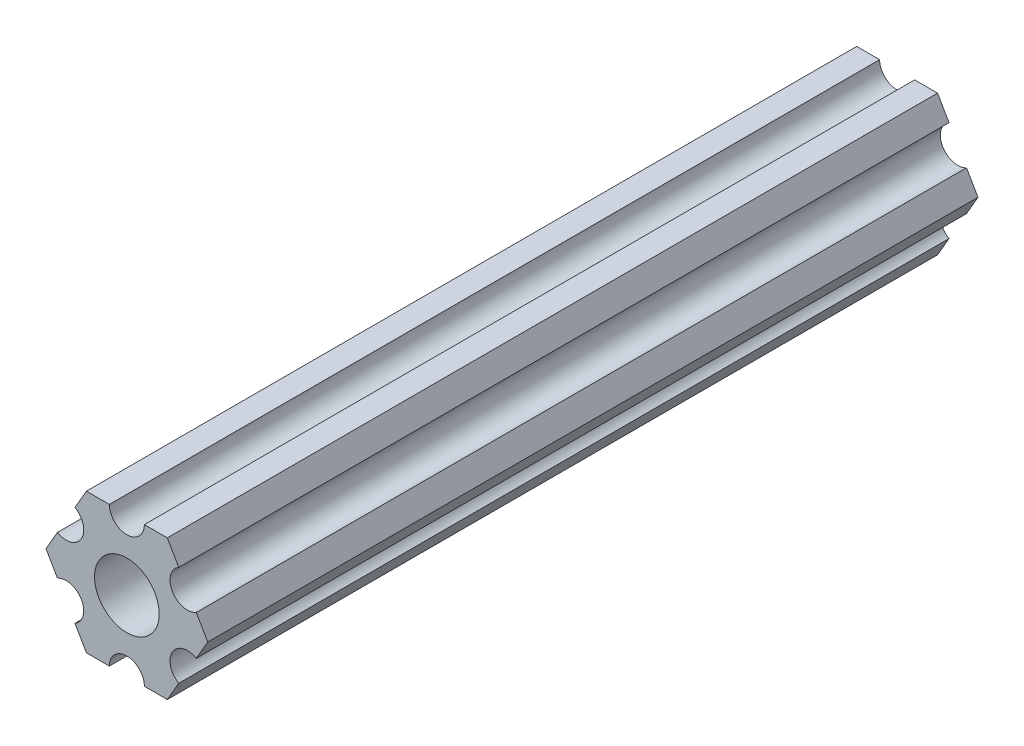
ISO-10303-21;
HEADER;
FILE_DESCRIPTION(('STEP AP214'),'2;1');
FILE_NAME('part.step','',(''),(''),'','','');
FILE_SCHEMA(('AUTOMOTIVE_DESIGN { 1 0 10303 214 1 1 1 1 }'));
ENDSEC;
DATA;
#1=APPLICATION_CONTEXT('core data for automotive mechanical design processes');
#2=APPLICATION_PROTOCOL_DEFINITION('international standard','automotive_design',2000,#1);
#3=PRODUCT_CONTEXT('',#1,'mechanical');
#4=PRODUCT('Part','Part','',(#3));
#5=PRODUCT_RELATED_PRODUCT_CATEGORY('part','',(#4));
#6=PRODUCT_DEFINITION_FORMATION('','',#4);
#7=PRODUCT_DEFINITION_CONTEXT('part definition',#1,'design');
#8=PRODUCT_DEFINITION('design','',#6,#7);
#9=PRODUCT_DEFINITION_SHAPE('','',#8);
#10=(LENGTH_UNIT() NAMED_UNIT(*) SI_UNIT(.MILLI.,.METRE.));
#11=(NAMED_UNIT(*) PLANE_ANGLE_UNIT() SI_UNIT($,.RADIAN.));
#12=(NAMED_UNIT(*) SI_UNIT($,.STERADIAN.) SOLID_ANGLE_UNIT());
#13=UNCERTAINTY_MEASURE_WITH_UNIT(LENGTH_MEASURE(1.E-05),#10,'distance_accuracy_value','');
#14=(GEOMETRIC_REPRESENTATION_CONTEXT(3) GLOBAL_UNCERTAINTY_ASSIGNED_CONTEXT((#13)) GLOBAL_UNIT_ASSIGNED_CONTEXT((#10,
#11,#12)) REPRESENTATION_CONTEXT('',''));
#15=CARTESIAN_POINT('',(0.,0.,0.));
#16=DIRECTION('',(0.,0.,1.));
#17=DIRECTION('',(1.,0.,0.));
#18=AXIS2_PLACEMENT_3D('',#15,#16,#17);
#19=CARTESIAN_POINT('',(6.29301142309098,-1.80018429024546,304.8));
#20=DIRECTION('',(-0.866025434075723,0.499999947533953,0.));
#21=DIRECTION('',(-0.499999947533953,-0.866025434075723,0.));
#22=AXIS2_PLACEMENT_3D('',#19,#20,#21);
#23=PLANE('',#22);
#24=DIRECTION('',(0.,0.,1.));
#25=VECTOR('',#24,1.);
#26=CARTESIAN_POINT('',(6.29301142309098,-1.80018429024547,304.8));
#27=LINE('',#26,#25);
#28=CARTESIAN_POINT('',(6.29301142309098,-1.80018429024547,69.85));
#29=VERTEX_POINT('',#28);
#30=CARTESIAN_POINT('',(6.29301142309098,-1.80018429024547,0.));
#31=VERTEX_POINT('',#30);
#32=EDGE_CURVE('E231',#29,#31,#27,.F.);
#33=ORIENTED_EDGE('',*,*,#32,.T.);
#34=DIRECTION('',(0.500000040068746,0.866025380650736,0.));
#35=VECTOR('',#34,1.);
#36=CARTESIAN_POINT('',(6.29301142309098,-1.80018429024546,0.));
#37=LINE('',#36,#35);
#38=CARTESIAN_POINT('',(7.33234841870827,0.,0.));
#39=VERTEX_POINT('',#38);
#40=EDGE_CURVE('E142',#31,#39,#37,.T.);
#41=ORIENTED_EDGE('',*,*,#40,.T.);
#42=DIRECTION('',(0.,0.,1.));
#43=VECTOR('',#42,1.);
#44=CARTESIAN_POINT('',(7.33234841870827,0.,304.8));
#45=LINE('',#44,#43);
#46=CARTESIAN_POINT('',(7.33234841870827,0.,69.85));
#47=VERTEX_POINT('',#46);
#48=EDGE_CURVE('E146',#39,#47,#45,.T.);
#49=ORIENTED_EDGE('',*,*,#48,.T.);
#50=DIRECTION('',(0.500000040068743,0.866025380650737,0.));
#51=VECTOR('',#50,1.);
#52=CARTESIAN_POINT('',(6.29301142309098,-1.80018429024547,69.85));
#53=LINE('',#52,#51);
#54=EDGE_CURVE('E133',#29,#47,#53,.T.);
#55=ORIENTED_EDGE('',*,*,#54,.F.);
#56=EDGE_LOOP('',(#33,#41,#49,#55));
#57=FACE_BOUND('',#56,.T.);
#58=ADVANCED_FACE('F17',(#57),#23,.F.);
#59=CARTESIAN_POINT('',(7.33234841870827,0.,304.8));
#60=DIRECTION('',(-0.866025373493145,-0.500000052466057,0.));
#61=DIRECTION('',(0.500000052466057,-0.866025373493145,0.));
#62=AXIS2_PLACEMENT_3D('',#59,#60,#61);
#63=PLANE('',#62);
#64=ORIENTED_EDGE('',*,*,#48,.F.);
#65=DIRECTION('',(-0.499999959931286,0.86602542691812,0.));
#66=VECTOR('',#65,1.);
#67=CARTESIAN_POINT('',(7.33234841870827,0.,0.));
#68=LINE('',#67,#66);
#69=CARTESIAN_POINT('',(6.29301120497138,1.80018505273895,0.));
#70=VERTEX_POINT('',#69);
#71=EDGE_CURVE('E225',#39,#70,#68,.T.);
#72=ORIENTED_EDGE('',*,*,#71,.T.);
#73=DIRECTION('',(0.,0.,1.));
#74=VECTOR('',#73,1.);
#75=CARTESIAN_POINT('',(6.29301120497138,1.80018505273895,304.8));
#76=LINE('',#75,#74);
#77=CARTESIAN_POINT('',(6.29301120497138,1.80018505273895,69.85));
#78=VERTEX_POINT('',#77);
#79=EDGE_CURVE('E151',#70,#78,#76,.T.);
#80=ORIENTED_EDGE('',*,*,#79,.T.);
#81=DIRECTION('',(-0.499999959931286,0.86602542691812,0.));
#82=VECTOR('',#81,1.);
#83=CARTESIAN_POINT('',(7.33234841870827,0.,69.85));
#84=LINE('',#83,#82);
#85=EDGE_CURVE('E137',#47,#78,#84,.T.);
#86=ORIENTED_EDGE('',*,*,#85,.F.);
#87=EDGE_LOOP('',(#64,#72,#80,#86));
#88=FACE_BOUND('',#87,.T.);
#89=ADVANCED_FACE('F153',(#88),#63,.F.);
#90=CARTESIAN_POINT('',(5.49926112168156,3.17500033315934,304.8));
#91=DIRECTION('',(0.,0.,1.));
#92=DIRECTION('',(1.,0.,0.));
#93=AXIS2_PLACEMENT_3D('',#90,#91,#92);
#94=CYLINDRICAL_SURFACE('',#93,1.5875);
#95=ORIENTED_EDGE('',*,*,#79,.F.);
#96=CARTESIAN_POINT('',(5.49926112168156,3.17500033315934,0.));
#97=DIRECTION('',(0.,0.,1.));
#98=DIRECTION('',(1.,0.,0.));
#99=AXIS2_PLACEMENT_3D('',#96,#97,#98);
#100=CIRCLE('',#99,1.5875);
#101=CARTESIAN_POINT('',(4.70551103839172,4.54981561357972,0.));
#102=VERTEX_POINT('',#101);
#103=EDGE_CURVE('E222',#70,#102,#100,.F.);
#104=ORIENTED_EDGE('',*,*,#103,.T.);
#105=DIRECTION('',(0.,0.,1.));
#106=VECTOR('',#105,1.);
#107=CARTESIAN_POINT('',(4.70551103839172,4.54981561357972,304.8));
#108=LINE('',#107,#106);
#109=CARTESIAN_POINT('',(4.70551103839172,4.54981561357972,69.85));
#110=VERTEX_POINT('',#109);
#111=EDGE_CURVE('E275',#102,#110,#108,.T.);
#112=ORIENTED_EDGE('',*,*,#111,.T.);
#113=CARTESIAN_POINT('',(5.49926112168156,3.17500033315934,69.85));
#114=DIRECTION('',(0.,0.,1.));
#115=DIRECTION('',(1.,0.,0.));
#116=AXIS2_PLACEMENT_3D('',#113,#114,#115);
#117=CIRCLE('',#116,1.5875);
#118=EDGE_CURVE('E155',#78,#110,#117,.F.);
#119=ORIENTED_EDGE('',*,*,#118,.F.);
#120=EDGE_LOOP('',(#95,#104,#112,#119));
#121=FACE_BOUND('',#120,.T.);
#122=ADVANCED_FACE('F313',(#121),#94,.F.);
#123=CARTESIAN_POINT('',(4.70551103839172,4.54981561357972,304.8));
#124=DIRECTION('',(-0.866025373493151,-0.500000052466046,0.));
#125=DIRECTION('',(0.500000052466046,-0.866025373493151,0.));
#126=AXIS2_PLACEMENT_3D('',#123,#124,#125);
#127=PLANE('',#126);
#128=ORIENTED_EDGE('',*,*,#111,.F.);
#129=DIRECTION('',(-0.500000052466044,0.866025373493152,0.));
#130=VECTOR('',#129,1.);
#131=CARTESIAN_POINT('',(4.70551103839172,4.54981561357972,0.));
#132=LINE('',#131,#130);
#133=CARTESIAN_POINT('',(3.66617382465481,6.35000022210627,0.));
#134=VERTEX_POINT('',#133);
#135=EDGE_CURVE('E217',#102,#134,#132,.T.);
#136=ORIENTED_EDGE('',*,*,#135,.T.);
#137=DIRECTION('',(0.,0.,-1.));
#138=VECTOR('',#137,1.);
#139=CARTESIAN_POINT('',(3.66617382465481,6.35000022210627,304.8));
#140=LINE('',#139,#138);
#141=CARTESIAN_POINT('',(3.66617382465481,6.35000022210627,69.85));
#142=VERTEX_POINT('',#141);
#143=EDGE_CURVE('E127',#134,#142,#140,.F.);
#144=ORIENTED_EDGE('',*,*,#143,.T.);
#145=DIRECTION('',(-0.500000052466043,0.866025373493152,0.));
#146=VECTOR('',#145,1.);
#147=CARTESIAN_POINT('',(4.70551103839172,4.54981561357972,69.85));
#148=LINE('',#147,#146);
#149=EDGE_CURVE('E157',#110,#142,#148,.T.);
#150=ORIENTED_EDGE('',*,*,#149,.F.);
#151=EDGE_LOOP('',(#128,#136,#144,#150));
#152=FACE_BOUND('',#151,.T.);
#153=ADVANCED_FACE('F320',(#152),#127,.F.);
#154=CARTESIAN_POINT('',(3.66617382465481,6.35000022210627,304.8));
#155=DIRECTION('',(0.,-1.,0.));
#156=DIRECTION('',(0.,0.,-1.));
#157=AXIS2_PLACEMENT_3D('',#154,#155,#156);
#158=PLANE('',#157);
#159=ORIENTED_EDGE('',*,*,#143,.F.);
#160=DIRECTION('',(1.,0.,0.));
#161=VECTOR('',#160,1.);
#162=CARTESIAN_POINT('',(5.49926112168156,6.35000022210627,0.));
#163=LINE('',#162,#161);
#164=CARTESIAN_POINT('',(1.58749980765036,6.35000022210627,0.));
#165=VERTEX_POINT('',#164);
#166=EDGE_CURVE('E215',#134,#165,#163,.F.);
#167=ORIENTED_EDGE('',*,*,#166,.T.);
#168=DIRECTION('',(0.,0.,-1.));
#169=VECTOR('',#168,1.);
#170=CARTESIAN_POINT('',(1.58749961530074,6.35000022210627,304.8));
#171=LINE('',#170,#169);
#172=CARTESIAN_POINT('',(1.58749980765036,6.35000022210627,69.85));
#173=VERTEX_POINT('',#172);
#174=EDGE_CURVE('E20',#165,#173,#171,.F.);
#175=ORIENTED_EDGE('',*,*,#174,.T.);
#176=DIRECTION('',(1.,0.,0.));
#177=VECTOR('',#176,1.);
#178=CARTESIAN_POINT('',(2.8806272894144,6.35000022210627,69.85));
#179=LINE('',#178,#177);
#180=EDGE_CURVE('E300',#142,#173,#179,.F.);
#181=ORIENTED_EDGE('',*,*,#180,.F.);
#182=EDGE_LOOP('',(#159,#167,#175,#181));
#183=FACE_BOUND('',#182,.T.);
#184=ADVANCED_FACE('F385',(#183),#158,.F.);
#185=CARTESIAN_POINT('',(0.,6.35,304.8));
#186=DIRECTION('',(0.,0.,1.));
#187=DIRECTION('',(1.,0.,0.));
#188=AXIS2_PLACEMENT_3D('',#185,#186,#187);
#189=CYLINDRICAL_SURFACE('',#188,1.5875);
#190=ORIENTED_EDGE('',*,*,#174,.F.);
#191=CARTESIAN_POINT('',(0.,6.35,0.));
#192=DIRECTION('',(0.,0.,1.));
#193=DIRECTION('',(1.,0.,0.));
#194=AXIS2_PLACEMENT_3D('',#191,#192,#193);
#195=CIRCLE('',#194,1.5875);
#196=CARTESIAN_POINT('',(-1.58750019234963,6.34999990382518,0.));
#197=VERTEX_POINT('',#196);
#198=EDGE_CURVE('E212',#165,#197,#195,.F.);
#199=ORIENTED_EDGE('',*,*,#198,.T.);
#200=DIRECTION('',(0.,0.,-1.));
#201=VECTOR('',#200,1.);
#202=CARTESIAN_POINT('',(-1.58750038469926,6.34999990382518,304.8));
#203=LINE('',#202,#201);
#204=CARTESIAN_POINT('',(-1.58750019234963,6.34999990382518,69.85));
#205=VERTEX_POINT('',#204);
#206=EDGE_CURVE('E269',#197,#205,#203,.F.);
#207=ORIENTED_EDGE('',*,*,#206,.T.);
#208=CARTESIAN_POINT('',(0.,6.35,69.85));
#209=DIRECTION('',(0.,0.,1.));
#210=DIRECTION('',(1.,0.,0.));
#211=AXIS2_PLACEMENT_3D('',#208,#209,#210);
#212=CIRCLE('',#211,1.5875);
#213=EDGE_CURVE('E298',#173,#205,#212,.F.);
#214=ORIENTED_EDGE('',*,*,#213,.F.);
#215=EDGE_LOOP('',(#190,#199,#207,#214));
#216=FACE_BOUND('',#215,.T.);
#217=ADVANCED_FACE('F384',(#216),#189,.F.);
#218=CARTESIAN_POINT('',(-1.58750038469926,6.34999990382518,304.8));
#219=DIRECTION('',(0.,-1.,0.));
#220=DIRECTION('',(0.,0.,-1.));
#221=AXIS2_PLACEMENT_3D('',#218,#219,#220);
#222=PLANE('',#221);
#223=ORIENTED_EDGE('',*,*,#206,.F.);
#224=DIRECTION('',(1.,0.,0.));
#225=VECTOR('',#224,1.);
#226=CARTESIAN_POINT('',(5.49926112168156,6.34999990382519,0.));
#227=LINE('',#226,#225);
#228=CARTESIAN_POINT('',(-3.66617454558244,6.34999986184803,0.));
#229=VERTEX_POINT('',#228);
#230=EDGE_CURVE('E207',#197,#229,#227,.F.);
#231=ORIENTED_EDGE('',*,*,#230,.T.);
#232=DIRECTION('',(0.,0.,1.));
#233=VECTOR('',#232,1.);
#234=CARTESIAN_POINT('',(-3.66617459405349,6.3499997778937,304.8));
#235=LINE('',#234,#233);
#236=CARTESIAN_POINT('',(-3.66617454558245,6.34999986184802,69.85));
#237=VERTEX_POINT('',#236);
#238=EDGE_CURVE('E266',#229,#237,#235,.T.);
#239=ORIENTED_EDGE('',*,*,#238,.T.);
#240=DIRECTION('',(1.,0.,0.));
#241=VECTOR('',#240,1.);
#242=CARTESIAN_POINT('',(2.8806272894144,6.34999990382518,69.85));
#243=LINE('',#242,#241);
#244=EDGE_CURVE('E299',#205,#237,#243,.F.);
#245=ORIENTED_EDGE('',*,*,#244,.F.);
#246=EDGE_LOOP('',(#223,#231,#239,#245));
#247=FACE_BOUND('',#246,.T.);
#248=ADVANCED_FACE('F383',(#247),#222,.F.);
#249=CARTESIAN_POINT('',(-3.66617459405349,6.3499997778937,304.8));
#250=DIRECTION('',(0.866025434075729,-0.499999947533942,0.));
#251=DIRECTION('',(0.499999947533942,0.866025434075729,0.));
#252=AXIS2_PLACEMENT_3D('',#249,#250,#251);
#253=PLANE('',#252);
#254=ORIENTED_EDGE('',*,*,#238,.F.);
#255=DIRECTION('',(-0.499999947533941,-0.86602543407573,0.));
#256=VECTOR('',#255,1.);
#257=CARTESIAN_POINT('',(-3.66617459405349,6.3499997778937,0.));
#258=LINE('',#257,#256);
#259=CARTESIAN_POINT('',(-4.70551158967065,4.54981504343587,0.));
#260=VERTEX_POINT('',#259);
#261=EDGE_CURVE('E204',#229,#260,#258,.T.);
#262=ORIENTED_EDGE('',*,*,#261,.T.);
#263=DIRECTION('',(0.,0.,1.));
#264=VECTOR('',#263,1.);
#265=CARTESIAN_POINT('',(-4.70551158967065,4.54981504343587,304.8));
#266=LINE('',#265,#264);
#267=CARTESIAN_POINT('',(-4.70551158967065,4.54981504343587,69.85));
#268=VERTEX_POINT('',#267);
#269=EDGE_CURVE('E263',#260,#268,#266,.T.);
#270=ORIENTED_EDGE('',*,*,#269,.T.);
#271=DIRECTION('',(-0.49999994753394,-0.86602543407573,0.));
#272=VECTOR('',#271,1.);
#273=CARTESIAN_POINT('',(-3.66617459405349,6.3499997778937,69.85));
#274=LINE('',#273,#272);
#275=EDGE_CURVE('E297',#237,#268,#274,.T.);
#276=ORIENTED_EDGE('',*,*,#275,.F.);
#277=EDGE_LOOP('',(#254,#262,#270,#276));
#278=FACE_BOUND('',#277,.T.);
#279=ADVANCED_FACE('F377',(#278),#253,.F.);
#280=CARTESIAN_POINT('',(-5.49926150638082,3.17499966684067,304.8));
#281=DIRECTION('',(0.,0.,1.));
#282=DIRECTION('',(1.,0.,0.));
#283=AXIS2_PLACEMENT_3D('',#280,#281,#282);
#284=CYLINDRICAL_SURFACE('',#283,1.5875);
#285=ORIENTED_EDGE('',*,*,#269,.F.);
#286=CARTESIAN_POINT('',(-5.49926150638082,3.17499966684067,0.));
#287=DIRECTION('',(0.,0.,1.));
#288=DIRECTION('',(1.,0.,0.));
#289=AXIS2_PLACEMENT_3D('',#286,#287,#288);
#290=CIRCLE('',#289,1.5875);
#291=CARTESIAN_POINT('',(-6.29301142309098,1.80018429024547,0.));
#292=VERTEX_POINT('',#291);
#293=EDGE_CURVE('E201',#260,#292,#290,.F.);
#294=ORIENTED_EDGE('',*,*,#293,.T.);
#295=DIRECTION('',(0.,0.,1.));
#296=VECTOR('',#295,1.);
#297=CARTESIAN_POINT('',(-6.29301142309098,1.80018429024547,304.8));
#298=LINE('',#297,#296);
#299=CARTESIAN_POINT('',(-6.29301142309098,1.80018429024547,69.85));
#300=VERTEX_POINT('',#299);
#301=EDGE_CURVE('E258',#292,#300,#298,.T.);
#302=ORIENTED_EDGE('',*,*,#301,.T.);
#303=CARTESIAN_POINT('',(-5.49926150638082,3.17499966684067,69.85));
#304=DIRECTION('',(0.,0.,1.));
#305=DIRECTION('',(1.,0.,0.));
#306=AXIS2_PLACEMENT_3D('',#303,#304,#305);
#307=CIRCLE('',#306,1.5875);
#308=EDGE_CURVE('E294',#268,#300,#307,.F.);
#309=ORIENTED_EDGE('',*,*,#308,.F.);
#310=EDGE_LOOP('',(#285,#294,#302,#309));
#311=FACE_BOUND('',#310,.T.);
#312=ADVANCED_FACE('F388',(#311),#284,.F.);
#313=CARTESIAN_POINT('',(-6.29301142309098,1.80018429024547,304.8));
#314=DIRECTION('',(0.866025434075724,-0.499999947533952,0.));
#315=DIRECTION('',(0.499999947533952,0.866025434075724,0.));
#316=AXIS2_PLACEMENT_3D('',#313,#314,#315);
#317=PLANE('',#316);
#318=ORIENTED_EDGE('',*,*,#301,.F.);
#319=DIRECTION('',(-0.500000040068744,-0.866025380650737,0.));
#320=VECTOR('',#319,1.);
#321=CARTESIAN_POINT('',(-6.29301142309098,1.80018429024547,0.));
#322=LINE('',#321,#320);
#323=CARTESIAN_POINT('',(-7.33234841870827,0.,0.));
#324=VERTEX_POINT('',#323);
#325=EDGE_CURVE('E196',#292,#324,#322,.T.);
#326=ORIENTED_EDGE('',*,*,#325,.T.);
#327=DIRECTION('',(0.,0.,1.));
#328=VECTOR('',#327,1.);
#329=CARTESIAN_POINT('',(-7.33234841870827,0.,304.8));
#330=LINE('',#329,#328);
#331=CARTESIAN_POINT('',(-7.33234841870827,0.,69.85));
#332=VERTEX_POINT('',#331);
#333=EDGE_CURVE('E255',#324,#332,#330,.T.);
#334=ORIENTED_EDGE('',*,*,#333,.T.);
#335=DIRECTION('',(-0.500000040068743,-0.866025380650737,0.));
#336=VECTOR('',#335,1.);
#337=CARTESIAN_POINT('',(-6.29301142309098,1.80018429024547,69.85));
#338=LINE('',#337,#336);
#339=EDGE_CURVE('E296',#300,#332,#338,.T.);
#340=ORIENTED_EDGE('',*,*,#339,.F.);
#341=EDGE_LOOP('',(#318,#326,#334,#340));
#342=FACE_BOUND('',#341,.T.);
#343=ADVANCED_FACE('F391',(#342),#317,.F.);
#344=CARTESIAN_POINT('',(-7.33234841870827,0.,304.8));
#345=DIRECTION('',(0.866025373493151,0.500000052466045,0.));
#346=DIRECTION('',(-0.500000052466045,0.866025373493151,0.));
#347=AXIS2_PLACEMENT_3D('',#344,#345,#346);
#348=PLANE('',#347);
#349=ORIENTED_EDGE('',*,*,#333,.F.);
#350=DIRECTION('',(0.499999959931273,-0.866025426918128,0.));
#351=VECTOR('',#350,1.);
#352=CARTESIAN_POINT('',(-7.33234841870827,0.,0.));
#353=LINE('',#352,#351);
#354=CARTESIAN_POINT('',(-6.29301120497141,-1.80018505273897,0.));
#355=VERTEX_POINT('',#354);
#356=EDGE_CURVE('E193',#324,#355,#353,.T.);
#357=ORIENTED_EDGE('',*,*,#356,.T.);
#358=DIRECTION('',(0.,0.,1.));
#359=VECTOR('',#358,1.);
#360=CARTESIAN_POINT('',(-6.29301120497141,-1.80018505273897,304.8));
#361=LINE('',#360,#359);
#362=CARTESIAN_POINT('',(-6.29301120497141,-1.80018505273896,69.85));
#363=VERTEX_POINT('',#362);
#364=EDGE_CURVE('E252',#355,#363,#361,.T.);
#365=ORIENTED_EDGE('',*,*,#364,.T.);
#366=DIRECTION('',(0.499999959931275,-0.866025426918126,0.));
#367=VECTOR('',#366,1.);
#368=CARTESIAN_POINT('',(-7.33234841870827,0.,69.85));
#369=LINE('',#368,#367);
#370=EDGE_CURVE('E293',#332,#363,#369,.T.);
#371=ORIENTED_EDGE('',*,*,#370,.F.);
#372=EDGE_LOOP('',(#349,#357,#365,#371));
#373=FACE_BOUND('',#372,.T.);
#374=ADVANCED_FACE('F395',(#373),#348,.F.);
#375=CARTESIAN_POINT('',(-5.49926112168156,-3.17500033315934,304.8));
#376=DIRECTION('',(0.,0.,1.));
#377=DIRECTION('',(1.,0.,0.));
#378=AXIS2_PLACEMENT_3D('',#375,#376,#377);
#379=CYLINDRICAL_SURFACE('',#378,1.5875);
#380=ORIENTED_EDGE('',*,*,#364,.F.);
#381=CARTESIAN_POINT('',(-5.49926112168156,-3.17500033315934,0.));
#382=DIRECTION('',(0.,0.,1.));
#383=DIRECTION('',(1.,0.,0.));
#384=AXIS2_PLACEMENT_3D('',#381,#382,#383);
#385=CIRCLE('',#384,1.5875);
#386=CARTESIAN_POINT('',(-4.70551103839172,-4.54981561357972,0.));
#387=VERTEX_POINT('',#386);
#388=EDGE_CURVE('E190',#355,#387,#385,.F.);
#389=ORIENTED_EDGE('',*,*,#388,.T.);
#390=DIRECTION('',(0.,0.,1.));
#391=VECTOR('',#390,1.);
#392=CARTESIAN_POINT('',(-4.70551103839172,-4.54981561357972,304.8));
#393=LINE('',#392,#391);
#394=CARTESIAN_POINT('',(-4.70551103839172,-4.54981561357972,69.85));
#395=VERTEX_POINT('',#394);
#396=EDGE_CURVE('E247',#387,#395,#393,.T.);
#397=ORIENTED_EDGE('',*,*,#396,.T.);
#398=CARTESIAN_POINT('',(-5.49926112168156,-3.17500033315934,69.85));
#399=DIRECTION('',(0.,0.,1.));
#400=DIRECTION('',(1.,0.,0.));
#401=AXIS2_PLACEMENT_3D('',#398,#399,#400);
#402=CIRCLE('',#401,1.5875);
#403=EDGE_CURVE('E290',#363,#395,#402,.F.);
#404=ORIENTED_EDGE('',*,*,#403,.F.);
#405=EDGE_LOOP('',(#380,#389,#397,#404));
#406=FACE_BOUND('',#405,.T.);
#407=ADVANCED_FACE('F399',(#406),#379,.F.);
#408=CARTESIAN_POINT('',(-4.70551103839172,-4.54981561357972,304.8));
#409=DIRECTION('',(0.866025373493151,0.500000052466045,0.));
#410=DIRECTION('',(-0.500000052466045,0.866025373493151,0.));
#411=AXIS2_PLACEMENT_3D('',#408,#409,#410);
#412=PLANE('',#411);
#413=ORIENTED_EDGE('',*,*,#396,.F.);
#414=DIRECTION('',(0.500000052466041,-0.866025373493153,0.));
#415=VECTOR('',#414,1.);
#416=CARTESIAN_POINT('',(-4.70551103839172,-4.54981561357972,0.));
#417=LINE('',#416,#415);
#418=CARTESIAN_POINT('',(-3.66617382465481,-6.35000022210628,0.));
#419=VERTEX_POINT('',#418);
#420=EDGE_CURVE('E185',#387,#419,#417,.T.);
#421=ORIENTED_EDGE('',*,*,#420,.T.);
#422=DIRECTION('',(0.,0.,1.));
#423=VECTOR('',#422,1.);
#424=CARTESIAN_POINT('',(-3.66617382465481,-6.35000022210628,304.8));
#425=LINE('',#424,#423);
#426=CARTESIAN_POINT('',(-3.66617382465481,-6.35000022210628,69.85));
#427=VERTEX_POINT('',#426);
#428=EDGE_CURVE('E244',#419,#427,#425,.T.);
#429=ORIENTED_EDGE('',*,*,#428,.T.);
#430=DIRECTION('',(0.500000052466042,-0.866025373493153,0.));
#431=VECTOR('',#430,1.);
#432=CARTESIAN_POINT('',(-4.70551103839172,-4.54981561357972,69.85));
#433=LINE('',#432,#431);
#434=EDGE_CURVE('E292',#395,#427,#433,.T.);
#435=ORIENTED_EDGE('',*,*,#434,.F.);
#436=EDGE_LOOP('',(#413,#421,#429,#435));
#437=FACE_BOUND('',#436,.T.);
#438=ADVANCED_FACE('F403',(#437),#412,.F.);
#439=CARTESIAN_POINT('',(-3.66617382465481,-6.35000022210628,304.8));
#440=DIRECTION('',(0.,1.,0.));
#441=DIRECTION('',(0.,0.,1.));
#442=AXIS2_PLACEMENT_3D('',#439,#440,#441);
#443=PLANE('',#442);
#444=ORIENTED_EDGE('',*,*,#428,.F.);
#445=DIRECTION('',(1.,0.,0.));
#446=VECTOR('',#445,1.);
#447=CARTESIAN_POINT('',(5.49926112168156,-6.35000022210628,0.));
#448=LINE('',#447,#446);
#449=CARTESIAN_POINT('',(-1.58749999999999,-6.35000015914056,0.));
#450=VERTEX_POINT('',#449);
#451=EDGE_CURVE('E182',#419,#450,#448,.T.);
#452=ORIENTED_EDGE('',*,*,#451,.T.);
#453=DIRECTION('',(0.,0.,1.));
#454=VECTOR('',#453,1.);
#455=CARTESIAN_POINT('',(-1.5875,-6.35000009617484,304.8));
#456=LINE('',#455,#454);
#457=CARTESIAN_POINT('',(-1.58749999999999,-6.35000015914056,69.85));
#458=VERTEX_POINT('',#457);
#459=EDGE_CURVE('E241',#450,#458,#456,.T.);
#460=ORIENTED_EDGE('',*,*,#459,.T.);
#461=DIRECTION('',(1.,0.,0.));
#462=VECTOR('',#461,1.);
#463=CARTESIAN_POINT('',(2.8806272894144,-6.35000022210628,69.85));
#464=LINE('',#463,#462);
#465=EDGE_CURVE('E289',#427,#458,#464,.T.);
#466=ORIENTED_EDGE('',*,*,#465,.F.);
#467=EDGE_LOOP('',(#444,#452,#460,#466));
#468=FACE_BOUND('',#467,.T.);
#469=ADVANCED_FACE('F406',(#468),#443,.F.);
#470=CARTESIAN_POINT('',(0.,-6.35,304.8));
#471=DIRECTION('',(0.,0.,1.));
#472=DIRECTION('',(1.,0.,0.));
#473=AXIS2_PLACEMENT_3D('',#470,#471,#472);
#474=CYLINDRICAL_SURFACE('',#473,1.5875);
#475=ORIENTED_EDGE('',*,*,#459,.F.);
#476=CARTESIAN_POINT('',(0.,-6.35,0.));
#477=DIRECTION('',(0.,0.,1.));
#478=DIRECTION('',(1.,0.,0.));
#479=AXIS2_PLACEMENT_3D('',#476,#477,#478);
#480=CIRCLE('',#479,1.5875);
#481=CARTESIAN_POINT('',(1.58750019234963,-6.34999990382518,0.));
#482=VERTEX_POINT('',#481);
#483=EDGE_CURVE('E179',#450,#482,#480,.F.);
#484=ORIENTED_EDGE('',*,*,#483,.T.);
#485=DIRECTION('',(0.,0.,1.));
#486=VECTOR('',#485,1.);
#487=CARTESIAN_POINT('',(1.58750038469926,-6.34999990382518,304.8));
#488=LINE('',#487,#486);
#489=CARTESIAN_POINT('',(1.58750019234963,-6.34999990382518,69.85));
#490=VERTEX_POINT('',#489);
#491=EDGE_CURVE('E236',#482,#490,#488,.T.);
#492=ORIENTED_EDGE('',*,*,#491,.T.);
#493=CARTESIAN_POINT('',(0.,-6.35,69.85));
#494=DIRECTION('',(0.,0.,1.));
#495=DIRECTION('',(1.,0.,0.));
#496=AXIS2_PLACEMENT_3D('',#493,#494,#495);
#497=CIRCLE('',#496,1.5875);
#498=EDGE_CURVE('E286',#458,#490,#497,.F.);
#499=ORIENTED_EDGE('',*,*,#498,.F.);
#500=EDGE_LOOP('',(#475,#484,#492,#499));
#501=FACE_BOUND('',#500,.T.);
#502=ADVANCED_FACE('F409',(#501),#474,.F.);
#503=CARTESIAN_POINT('',(1.58750038469926,-6.34999990382518,304.8));
#504=DIRECTION('',(0.,1.,0.));
#505=DIRECTION('',(0.,0.,1.));
#506=AXIS2_PLACEMENT_3D('',#503,#504,#505);
#507=PLANE('',#506);
#508=ORIENTED_EDGE('',*,*,#491,.F.);
#509=DIRECTION('',(1.,0.,0.));
#510=VECTOR('',#509,1.);
#511=CARTESIAN_POINT('',(5.49926112168156,-6.34999990382518,0.));
#512=LINE('',#511,#510);
#513=CARTESIAN_POINT('',(3.66617454558244,-6.34999986184804,0.));
#514=VERTEX_POINT('',#513);
#515=EDGE_CURVE('E174',#482,#514,#512,.T.);
#516=ORIENTED_EDGE('',*,*,#515,.T.);
#517=DIRECTION('',(0.,0.,1.));
#518=VECTOR('',#517,1.);
#519=CARTESIAN_POINT('',(3.66617459405346,-6.34999977789375,304.8));
#520=LINE('',#519,#518);
#521=CARTESIAN_POINT('',(3.66617454584953,-6.34999986184804,69.85));
#522=VERTEX_POINT('',#521);
#523=EDGE_CURVE('E233',#514,#522,#520,.T.);
#524=ORIENTED_EDGE('',*,*,#523,.T.);
#525=DIRECTION('',(1.,0.,0.));
#526=VECTOR('',#525,1.);
#527=CARTESIAN_POINT('',(2.8806272894144,-6.34999990382518,69.85));
#528=LINE('',#527,#526);
#529=EDGE_CURVE('E288',#490,#522,#528,.T.);
#530=ORIENTED_EDGE('',*,*,#529,.F.);
#531=EDGE_LOOP('',(#508,#516,#524,#530));
#532=FACE_BOUND('',#531,.T.);
#533=ADVANCED_FACE('F357',(#532),#507,.F.);
#534=CARTESIAN_POINT('',(3.66617459405346,-6.34999977789375,304.8));
#535=DIRECTION('',(-0.86602543407573,0.499999947533941,0.));
#536=DIRECTION('',(-0.499999947533941,-0.86602543407573,0.));
#537=AXIS2_PLACEMENT_3D('',#534,#535,#536);
#538=PLANE('',#537);
#539=ORIENTED_EDGE('',*,*,#523,.F.);
#540=DIRECTION('',(0.499999947533941,0.86602543407573,0.));
#541=VECTOR('',#540,1.);
#542=CARTESIAN_POINT('',(3.66617459405346,-6.34999977789375,0.));
#543=LINE('',#542,#541);
#544=CARTESIAN_POINT('',(4.70551158967065,-4.54981504343587,0.));
#545=VERTEX_POINT('',#544);
#546=EDGE_CURVE('E171',#514,#545,#543,.T.);
#547=ORIENTED_EDGE('',*,*,#546,.T.);
#548=DIRECTION('',(0.,0.,1.));
#549=VECTOR('',#548,1.);
#550=CARTESIAN_POINT('',(4.70551158967065,-4.54981504343587,304.8));
#551=LINE('',#550,#549);
#552=CARTESIAN_POINT('',(4.70551158967065,-4.54981504343587,69.85));
#553=VERTEX_POINT('',#552);
#554=EDGE_CURVE('E227',#545,#553,#551,.T.);
#555=ORIENTED_EDGE('',*,*,#554,.T.);
#556=DIRECTION('',(0.499999947389385,0.866025434159189,0.));
#557=VECTOR('',#556,1.);
#558=CARTESIAN_POINT('',(3.66617459430746,-6.34999977814775,69.85));
#559=LINE('',#558,#557);
#560=EDGE_CURVE('E35',#522,#553,#559,.T.);
#561=ORIENTED_EDGE('',*,*,#560,.F.);
#562=EDGE_LOOP('',(#539,#547,#555,#561));
#563=FACE_BOUND('',#562,.T.);
#564=ADVANCED_FACE('F361',(#563),#538,.F.);
#565=CARTESIAN_POINT('',(5.49926150638082,-3.17499966684067,304.8));
#566=DIRECTION('',(0.,0.,1.));
#567=DIRECTION('',(1.,0.,0.));
#568=AXIS2_PLACEMENT_3D('',#565,#566,#567);
#569=CYLINDRICAL_SURFACE('',#568,1.5875);
#570=ORIENTED_EDGE('',*,*,#554,.F.);
#571=CARTESIAN_POINT('',(5.49926150638082,-3.17499966684067,0.));
#572=DIRECTION('',(0.,0.,1.));
#573=DIRECTION('',(1.,0.,0.));
#574=AXIS2_PLACEMENT_3D('',#571,#572,#573);
#575=CIRCLE('',#574,1.5875);
#576=EDGE_CURVE('E168',#545,#31,#575,.F.);
#577=ORIENTED_EDGE('',*,*,#576,.T.);
#578=ORIENTED_EDGE('',*,*,#32,.F.);
#579=CARTESIAN_POINT('',(5.49926150638082,-3.17499966684067,69.85));
#580=DIRECTION('',(0.,0.,1.));
#581=DIRECTION('',(1.,0.,0.));
#582=AXIS2_PLACEMENT_3D('',#579,#580,#581);
#583=CIRCLE('',#582,1.5875);
#584=EDGE_CURVE('E140',#553,#29,#583,.F.);
#585=ORIENTED_EDGE('',*,*,#584,.F.);
#586=EDGE_LOOP('',(#570,#577,#578,#585));
#587=FACE_BOUND('',#586,.T.);
#588=ADVANCED_FACE('F363',(#587),#569,.F.);
#589=CARTESIAN_POINT('',(5.49926112168156,3.17500033315934,0.));
#590=DIRECTION('',(0.,0.,1.));
#591=DIRECTION('',(1.,0.,0.));
#592=AXIS2_PLACEMENT_3D('',#589,#590,#591);
#593=PLANE('',#592);
#594=CARTESIAN_POINT('',(0.,0.,0.));
#595=DIRECTION('',(0.,0.,1.));
#596=DIRECTION('',(1.,0.,0.));
#597=AXIS2_PLACEMENT_3D('',#594,#595,#596);
#598=CIRCLE('',#597,2.9337);
#599=CARTESIAN_POINT('',(2.9337,0.,0.));
#600=VERTEX_POINT('',#599);
#601=EDGE_CURVE('E26',#600,#600,#598,.T.);
#602=ORIENTED_EDGE('',*,*,#601,.T.);
#603=EDGE_LOOP('',(#602));
#604=FACE_BOUND('',#603,.T.);
#605=ORIENTED_EDGE('',*,*,#576,.F.);
#606=ORIENTED_EDGE('',*,*,#546,.F.);
#607=ORIENTED_EDGE('',*,*,#515,.F.);
#608=ORIENTED_EDGE('',*,*,#483,.F.);
#609=ORIENTED_EDGE('',*,*,#451,.F.);
#610=ORIENTED_EDGE('',*,*,#420,.F.);
#611=ORIENTED_EDGE('',*,*,#388,.F.);
#612=ORIENTED_EDGE('',*,*,#356,.F.);
#613=ORIENTED_EDGE('',*,*,#325,.F.);
#614=ORIENTED_EDGE('',*,*,#293,.F.);
#615=ORIENTED_EDGE('',*,*,#261,.F.);
#616=ORIENTED_EDGE('',*,*,#230,.F.);
#617=ORIENTED_EDGE('',*,*,#198,.F.);
#618=ORIENTED_EDGE('',*,*,#166,.F.);
#619=ORIENTED_EDGE('',*,*,#135,.F.);
#620=ORIENTED_EDGE('',*,*,#103,.F.);
#621=ORIENTED_EDGE('',*,*,#71,.F.);
#622=ORIENTED_EDGE('',*,*,#40,.F.);
#623=EDGE_LOOP('',(#605,#606,#607,#608,#609,#610,#611,#612,#613,#614,#615,#616,#617,#618,#619,
#620,#621,#622));
#624=FACE_BOUND('',#623,.T.);
#625=ADVANCED_FACE('F318',(#604,#624),#593,.F.);
#626=CARTESIAN_POINT('',(2.8806272894144,49.022,69.85));
#627=DIRECTION('',(0.,0.,1.));
#628=DIRECTION('',(1.,0.,0.));
#629=AXIS2_PLACEMENT_3D('',#626,#627,#628);
#630=PLANE('',#629);
#631=CARTESIAN_POINT('',(0.,0.,69.85));
#632=DIRECTION('',(0.,0.,1.));
#633=DIRECTION('',(1.,0.,0.));
#634=AXIS2_PLACEMENT_3D('',#631,#632,#633);
#635=CIRCLE('',#634,2.9337);
#636=CARTESIAN_POINT('',(2.9337,0.,69.85));
#637=VERTEX_POINT('',#636);
#638=EDGE_CURVE('E11',#637,#637,#635,.F.);
#639=ORIENTED_EDGE('',*,*,#638,.T.);
#640=EDGE_LOOP('',(#639));
#641=FACE_BOUND('',#640,.T.);
#642=ORIENTED_EDGE('',*,*,#560,.T.);
#643=ORIENTED_EDGE('',*,*,#584,.T.);
#644=ORIENTED_EDGE('',*,*,#54,.T.);
#645=ORIENTED_EDGE('',*,*,#85,.T.);
#646=ORIENTED_EDGE('',*,*,#118,.T.);
#647=ORIENTED_EDGE('',*,*,#149,.T.);
#648=ORIENTED_EDGE('',*,*,#180,.T.);
#649=ORIENTED_EDGE('',*,*,#213,.T.);
#650=ORIENTED_EDGE('',*,*,#244,.T.);
#651=ORIENTED_EDGE('',*,*,#275,.T.);
#652=ORIENTED_EDGE('',*,*,#308,.T.);
#653=ORIENTED_EDGE('',*,*,#339,.T.);
#654=ORIENTED_EDGE('',*,*,#370,.T.);
#655=ORIENTED_EDGE('',*,*,#403,.T.);
#656=ORIENTED_EDGE('',*,*,#434,.T.);
#657=ORIENTED_EDGE('',*,*,#465,.T.);
#658=ORIENTED_EDGE('',*,*,#498,.T.);
#659=ORIENTED_EDGE('',*,*,#529,.T.);
#660=EDGE_LOOP('',(#642,#643,#644,#645,#646,#647,#648,#649,#650,#651,#652,#653,#654,#655,#656,
#657,#658,#659));
#661=FACE_BOUND('',#660,.T.);
#662=ADVANCED_FACE('F135',(#641,#661),#630,.T.);
#663=CARTESIAN_POINT('',(0.,0.,304.8));
#664=DIRECTION('',(0.,0.,1.));
#665=DIRECTION('',(1.,0.,0.));
#666=AXIS2_PLACEMENT_3D('',#663,#664,#665);
#667=CYLINDRICAL_SURFACE('',#666,2.9337);
#668=ORIENTED_EDGE('',*,*,#638,.F.);
#669=EDGE_LOOP('',(#668));
#670=FACE_BOUND('',#669,.T.);
#671=ORIENTED_EDGE('',*,*,#601,.F.);
#672=EDGE_LOOP('',(#671));
#673=FACE_BOUND('',#672,.T.);
#674=ADVANCED_FACE('F419',(#670,#673),#667,.F.);
#675=CLOSED_SHELL('',(#58,#89,#122,#153,#184,#217,#248,#279,#312,#343,#374,#407,#438,#469,#502,
#533,#564,#588,#625,#662,#674));
#676=MANIFOLD_SOLID_BREP('B1',#675);
#677=ADVANCED_BREP_SHAPE_REPRESENTATION('',(#18,#676),#14);
#678=SHAPE_DEFINITION_REPRESENTATION(#9,#677);
ENDSEC;
END-ISO-10303-21;
